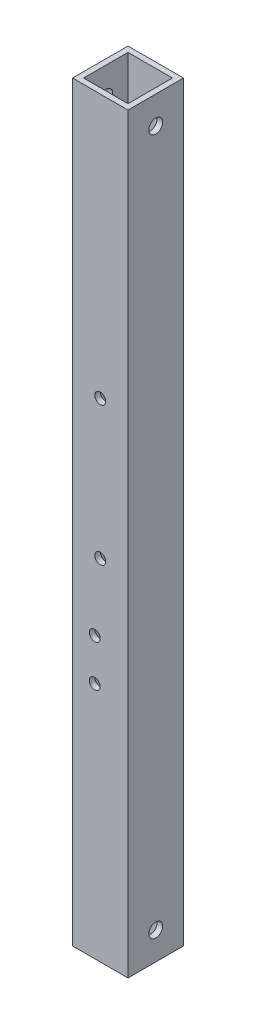
ISO-10303-21;
HEADER;
FILE_DESCRIPTION(('STEP AP214'),'2;1');
FILE_NAME('part.step','',(''),(''),'','','');
FILE_SCHEMA(('AUTOMOTIVE_DESIGN { 1 0 10303 214 1 1 1 1 }'));
ENDSEC;
DATA;
#1=APPLICATION_CONTEXT('core data for automotive mechanical design processes');
#2=APPLICATION_PROTOCOL_DEFINITION('international standard','automotive_design',2000,#1);
#3=PRODUCT_CONTEXT('',#1,'mechanical');
#4=PRODUCT('Part','Part','',(#3));
#5=PRODUCT_RELATED_PRODUCT_CATEGORY('part','',(#4));
#6=PRODUCT_DEFINITION_FORMATION('','',#4);
#7=PRODUCT_DEFINITION_CONTEXT('part definition',#1,'design');
#8=PRODUCT_DEFINITION('design','',#6,#7);
#9=PRODUCT_DEFINITION_SHAPE('','',#8);
#10=(LENGTH_UNIT() NAMED_UNIT(*) SI_UNIT(.MILLI.,.METRE.));
#11=(NAMED_UNIT(*) PLANE_ANGLE_UNIT() SI_UNIT($,.RADIAN.));
#12=(NAMED_UNIT(*) SI_UNIT($,.STERADIAN.) SOLID_ANGLE_UNIT());
#13=UNCERTAINTY_MEASURE_WITH_UNIT(LENGTH_MEASURE(1.E-05),#10,'distance_accuracy_value','');
#14=(GEOMETRIC_REPRESENTATION_CONTEXT(3) GLOBAL_UNCERTAINTY_ASSIGNED_CONTEXT((#13)) GLOBAL_UNIT_ASSIGNED_CONTEXT((#10,
#11,#12)) REPRESENTATION_CONTEXT('',''));
#15=CARTESIAN_POINT('',(0.,0.,0.));
#16=DIRECTION('',(0.,0.,1.));
#17=DIRECTION('',(1.,0.,0.));
#18=AXIS2_PLACEMENT_3D('',#15,#16,#17);
#19=CARTESIAN_POINT('',(0.,344.17,0.));
#20=DIRECTION('',(0.,1.,0.));
#21=DIRECTION('',(0.,0.,1.));
#22=AXIS2_PLACEMENT_3D('',#19,#20,#21);
#23=PLANE('',#22);
#24=DIRECTION('',(0.,0.,1.));
#25=VECTOR('',#24,1.);
#26=CARTESIAN_POINT('',(0.,344.17,0.));
#27=LINE('',#26,#25);
#28=CARTESIAN_POINT('',(0.,344.17,-25.4));
#29=VERTEX_POINT('',#28);
#30=CARTESIAN_POINT('',(0.,344.17,0.));
#31=VERTEX_POINT('',#30);
#32=EDGE_CURVE('E161',#29,#31,#27,.T.);
#33=ORIENTED_EDGE('',*,*,#32,.T.);
#34=DIRECTION('',(1.,0.,0.));
#35=VECTOR('',#34,1.);
#36=CARTESIAN_POINT('',(0.,344.17,0.));
#37=LINE('',#36,#35);
#38=CARTESIAN_POINT('',(25.4,344.17,0.));
#39=VERTEX_POINT('',#38);
#40=EDGE_CURVE('E164',#31,#39,#37,.T.);
#41=ORIENTED_EDGE('',*,*,#40,.T.);
#42=DIRECTION('',(0.,0.,-1.));
#43=VECTOR('',#42,1.);
#44=CARTESIAN_POINT('',(25.4,344.17,0.));
#45=LINE('',#44,#43);
#46=CARTESIAN_POINT('',(25.4,344.17,-25.4));
#47=VERTEX_POINT('',#46);
#48=EDGE_CURVE('E167',#39,#47,#45,.T.);
#49=ORIENTED_EDGE('',*,*,#48,.T.);
#50=DIRECTION('',(-1.,0.,0.));
#51=VECTOR('',#50,1.);
#52=CARTESIAN_POINT('',(0.,344.17,-25.4));
#53=LINE('',#52,#51);
#54=EDGE_CURVE('E169',#47,#29,#53,.T.);
#55=ORIENTED_EDGE('',*,*,#54,.T.);
#56=EDGE_LOOP('',(#33,#41,#49,#55));
#57=FACE_BOUND('',#56,.T.);
#58=DIRECTION('',(1.,0.,0.));
#59=VECTOR('',#58,1.);
#60=CARTESIAN_POINT('',(0.,344.17,-2.54));
#61=LINE('',#60,#59);
#62=CARTESIAN_POINT('',(2.54,344.17,-2.54));
#63=VERTEX_POINT('',#62);
#64=CARTESIAN_POINT('',(22.86,344.17,-2.54));
#65=VERTEX_POINT('',#64);
#66=EDGE_CURVE('E131',#63,#65,#61,.T.);
#67=ORIENTED_EDGE('',*,*,#66,.F.);
#68=DIRECTION('',(0.,0.,1.));
#69=VECTOR('',#68,1.);
#70=CARTESIAN_POINT('',(2.54,344.17,0.));
#71=LINE('',#70,#69);
#72=CARTESIAN_POINT('',(2.54,344.17,-22.86));
#73=VERTEX_POINT('',#72);
#74=EDGE_CURVE('E123',#73,#63,#71,.T.);
#75=ORIENTED_EDGE('',*,*,#74,.F.);
#76=DIRECTION('',(-1.,0.,0.));
#77=VECTOR('',#76,1.);
#78=CARTESIAN_POINT('',(0.,344.17,-22.86));
#79=LINE('',#78,#77);
#80=CARTESIAN_POINT('',(22.86,344.17,-22.86));
#81=VERTEX_POINT('',#80);
#82=EDGE_CURVE('E145',#81,#73,#79,.T.);
#83=ORIENTED_EDGE('',*,*,#82,.F.);
#84=DIRECTION('',(0.,0.,-1.));
#85=VECTOR('',#84,1.);
#86=CARTESIAN_POINT('',(22.86,344.17,0.));
#87=LINE('',#86,#85);
#88=EDGE_CURVE('E143',#65,#81,#87,.T.);
#89=ORIENTED_EDGE('',*,*,#88,.F.);
#90=EDGE_LOOP('',(#67,#75,#83,#89));
#91=FACE_BOUND('',#90,.T.);
#92=ADVANCED_FACE('F56',(#57,#91),#23,.T.);
#93=CARTESIAN_POINT('',(0.,0.,0.));
#94=DIRECTION('',(0.,1.,0.));
#95=DIRECTION('',(0.,0.,1.));
#96=AXIS2_PLACEMENT_3D('',#93,#94,#95);
#97=PLANE('',#96);
#98=DIRECTION('',(0.,0.,1.));
#99=VECTOR('',#98,1.);
#100=CARTESIAN_POINT('',(0.,0.,0.));
#101=LINE('',#100,#99);
#102=CARTESIAN_POINT('',(0.,0.,-25.4));
#103=VERTEX_POINT('',#102);
#104=CARTESIAN_POINT('',(0.,0.,0.));
#105=VERTEX_POINT('',#104);
#106=EDGE_CURVE('E139',#103,#105,#101,.T.);
#107=ORIENTED_EDGE('',*,*,#106,.F.);
#108=DIRECTION('',(-1.,0.,0.));
#109=VECTOR('',#108,1.);
#110=CARTESIAN_POINT('',(0.,0.,-25.4));
#111=LINE('',#110,#109);
#112=CARTESIAN_POINT('',(25.4,0.,-25.4));
#113=VERTEX_POINT('',#112);
#114=EDGE_CURVE('E165',#113,#103,#111,.T.);
#115=ORIENTED_EDGE('',*,*,#114,.F.);
#116=DIRECTION('',(0.,0.,-1.));
#117=VECTOR('',#116,1.);
#118=CARTESIAN_POINT('',(25.4,0.,0.));
#119=LINE('',#118,#117);
#120=CARTESIAN_POINT('',(25.4,0.,0.));
#121=VERTEX_POINT('',#120);
#122=EDGE_CURVE('E176',#121,#113,#119,.T.);
#123=ORIENTED_EDGE('',*,*,#122,.F.);
#124=DIRECTION('',(1.,0.,0.));
#125=VECTOR('',#124,1.);
#126=CARTESIAN_POINT('',(0.,0.,0.));
#127=LINE('',#126,#125);
#128=EDGE_CURVE('E174',#105,#121,#127,.T.);
#129=ORIENTED_EDGE('',*,*,#128,.F.);
#130=EDGE_LOOP('',(#107,#115,#123,#129));
#131=FACE_BOUND('',#130,.T.);
#132=DIRECTION('',(0.,0.,1.));
#133=VECTOR('',#132,1.);
#134=CARTESIAN_POINT('',(2.54,0.,0.));
#135=LINE('',#134,#133);
#136=CARTESIAN_POINT('',(2.54,0.,-22.86));
#137=VERTEX_POINT('',#136);
#138=CARTESIAN_POINT('',(2.54,0.,-2.54));
#139=VERTEX_POINT('',#138);
#140=EDGE_CURVE('E81',#137,#139,#135,.T.);
#141=ORIENTED_EDGE('',*,*,#140,.T.);
#142=DIRECTION('',(1.,0.,0.));
#143=VECTOR('',#142,1.);
#144=CARTESIAN_POINT('',(0.,0.,-2.54));
#145=LINE('',#144,#143);
#146=CARTESIAN_POINT('',(22.86,0.,-2.54));
#147=VERTEX_POINT('',#146);
#148=EDGE_CURVE('E138',#139,#147,#145,.T.);
#149=ORIENTED_EDGE('',*,*,#148,.T.);
#150=DIRECTION('',(0.,0.,-1.));
#151=VECTOR('',#150,1.);
#152=CARTESIAN_POINT('',(22.86,0.,0.));
#153=LINE('',#152,#151);
#154=CARTESIAN_POINT('',(22.86,0.,-22.86));
#155=VERTEX_POINT('',#154);
#156=EDGE_CURVE('E153',#147,#155,#153,.T.);
#157=ORIENTED_EDGE('',*,*,#156,.T.);
#158=DIRECTION('',(-1.,0.,0.));
#159=VECTOR('',#158,1.);
#160=CARTESIAN_POINT('',(0.,0.,-22.86));
#161=LINE('',#160,#159);
#162=EDGE_CURVE('E132',#155,#137,#161,.T.);
#163=ORIENTED_EDGE('',*,*,#162,.T.);
#164=EDGE_LOOP('',(#141,#149,#157,#163));
#165=FACE_BOUND('',#164,.T.);
#166=ADVANCED_FACE('F293',(#131,#165),#97,.F.);
#167=CARTESIAN_POINT('',(0.,344.17,0.));
#168=DIRECTION('',(1.,0.,0.));
#169=DIRECTION('',(0.,0.,-1.));
#170=AXIS2_PLACEMENT_3D('',#167,#168,#169);
#171=PLANE('',#170);
#172=CARTESIAN_POINT('',(0.,12.7,-12.7));
#173=DIRECTION('',(-1.,0.,0.));
#174=DIRECTION('',(0.,0.,1.));
#175=AXIS2_PLACEMENT_3D('',#172,#173,#174);
#176=CIRCLE('',#175,3.175);
#177=CARTESIAN_POINT('',(0.,12.7,-9.525));
#178=VERTEX_POINT('',#177);
#179=EDGE_CURVE('E210',#178,#178,#176,.T.);
#180=ORIENTED_EDGE('',*,*,#179,.F.);
#181=EDGE_LOOP('',(#180));
#182=FACE_BOUND('',#181,.T.);
#183=CARTESIAN_POINT('',(0.,331.47,-12.7));
#184=DIRECTION('',(-1.,0.,0.));
#185=DIRECTION('',(0.,0.,1.));
#186=AXIS2_PLACEMENT_3D('',#183,#184,#185);
#187=CIRCLE('',#186,3.175);
#188=CARTESIAN_POINT('',(0.,331.47,-9.525));
#189=VERTEX_POINT('',#188);
#190=EDGE_CURVE('E220',#189,#189,#187,.T.);
#191=ORIENTED_EDGE('',*,*,#190,.F.);
#192=EDGE_LOOP('',(#191));
#193=FACE_BOUND('',#192,.T.);
#194=ORIENTED_EDGE('',*,*,#106,.T.);
#195=DIRECTION('',(0.,-1.,0.));
#196=VECTOR('',#195,1.);
#197=CARTESIAN_POINT('',(0.,344.17,0.));
#198=LINE('',#197,#196);
#199=EDGE_CURVE('E12',#31,#105,#198,.T.);
#200=ORIENTED_EDGE('',*,*,#199,.F.);
#201=ORIENTED_EDGE('',*,*,#32,.F.);
#202=DIRECTION('',(0.,-1.,0.));
#203=VECTOR('',#202,1.);
#204=CARTESIAN_POINT('',(0.,344.17,-25.4));
#205=LINE('',#204,#203);
#206=EDGE_CURVE('E171',#29,#103,#205,.T.);
#207=ORIENTED_EDGE('',*,*,#206,.T.);
#208=EDGE_LOOP('',(#194,#200,#201,#207));
#209=FACE_BOUND('',#208,.T.);
#210=ADVANCED_FACE('F58',(#182,#193,#209),#171,.F.);
#211=CARTESIAN_POINT('',(0.,344.17,0.));
#212=DIRECTION('',(0.,0.,-1.));
#213=DIRECTION('',(-1.,0.,0.));
#214=AXIS2_PLACEMENT_3D('',#211,#212,#213);
#215=PLANE('',#214);
#216=CARTESIAN_POINT('',(10.16,109.1191,0.));
#217=DIRECTION('',(0.,0.,-1.));
#218=DIRECTION('',(-1.,0.,0.));
#219=AXIS2_PLACEMENT_3D('',#216,#217,#218);
#220=CIRCLE('',#219,2.48919999999999);
#221=CARTESIAN_POINT('',(7.67080000000006,109.1191,0.));
#222=VERTEX_POINT('',#221);
#223=EDGE_CURVE('E190',#222,#222,#220,.T.);
#224=ORIENTED_EDGE('',*,*,#223,.T.);
#225=EDGE_LOOP('',(#224));
#226=FACE_BOUND('',#225,.T.);
#227=CARTESIAN_POINT('',(10.16,128.1691,0.));
#228=DIRECTION('',(0.,0.,-1.));
#229=DIRECTION('',(-1.,0.,0.));
#230=AXIS2_PLACEMENT_3D('',#227,#228,#229);
#231=CIRCLE('',#230,2.48920000000001);
#232=CARTESIAN_POINT('',(7.67080000000004,128.1691,0.));
#233=VERTEX_POINT('',#232);
#234=EDGE_CURVE('E232',#233,#233,#231,.T.);
#235=ORIENTED_EDGE('',*,*,#234,.T.);
#236=EDGE_LOOP('',(#235));
#237=FACE_BOUND('',#236,.T.);
#238=CARTESIAN_POINT('',(12.6999999999999,160.02,0.));
#239=DIRECTION('',(0.,0.,-1.));
#240=DIRECTION('',(-1.,0.,0.));
#241=AXIS2_PLACEMENT_3D('',#238,#239,#240);
#242=CIRCLE('',#241,2.48919999999996);
#243=CARTESIAN_POINT('',(10.2107999999999,160.02,0.));
#244=VERTEX_POINT('',#243);
#245=EDGE_CURVE('E238',#244,#244,#242,.T.);
#246=ORIENTED_EDGE('',*,*,#245,.T.);
#247=EDGE_LOOP('',(#246));
#248=FACE_BOUND('',#247,.T.);
#249=CARTESIAN_POINT('',(12.7,223.52,0.));
#250=DIRECTION('',(0.,0.,-1.));
#251=DIRECTION('',(-1.,0.,0.));
#252=AXIS2_PLACEMENT_3D('',#249,#250,#251);
#253=CIRCLE('',#252,2.48919999999996);
#254=CARTESIAN_POINT('',(10.2108,223.52,0.));
#255=VERTEX_POINT('',#254);
#256=EDGE_CURVE('E244',#255,#255,#253,.T.);
#257=ORIENTED_EDGE('',*,*,#256,.T.);
#258=EDGE_LOOP('',(#257));
#259=FACE_BOUND('',#258,.T.);
#260=ORIENTED_EDGE('',*,*,#128,.T.);
#261=DIRECTION('',(0.,-1.,0.));
#262=VECTOR('',#261,1.);
#263=CARTESIAN_POINT('',(25.4,344.17,0.));
#264=LINE('',#263,#262);
#265=EDGE_CURVE('E65',#39,#121,#264,.T.);
#266=ORIENTED_EDGE('',*,*,#265,.F.);
#267=ORIENTED_EDGE('',*,*,#40,.F.);
#268=ORIENTED_EDGE('',*,*,#199,.T.);
#269=EDGE_LOOP('',(#260,#266,#267,#268));
#270=FACE_BOUND('',#269,.T.);
#271=ADVANCED_FACE('F279',(#226,#237,#248,#259,#270),#215,.F.);
#272=CARTESIAN_POINT('',(25.4,344.17,0.));
#273=DIRECTION('',(-1.,0.,0.));
#274=DIRECTION('',(0.,0.,1.));
#275=AXIS2_PLACEMENT_3D('',#272,#273,#274);
#276=PLANE('',#275);
#277=CARTESIAN_POINT('',(25.4,12.7,-12.7));
#278=DIRECTION('',(-1.,0.,0.));
#279=DIRECTION('',(0.,0.,1.));
#280=AXIS2_PLACEMENT_3D('',#277,#278,#279);
#281=CIRCLE('',#280,3.175);
#282=CARTESIAN_POINT('',(25.4,12.7,-9.525));
#283=VERTEX_POINT('',#282);
#284=EDGE_CURVE('E204',#283,#283,#281,.T.);
#285=ORIENTED_EDGE('',*,*,#284,.T.);
#286=EDGE_LOOP('',(#285));
#287=FACE_BOUND('',#286,.T.);
#288=CARTESIAN_POINT('',(25.4,331.47,-12.7));
#289=DIRECTION('',(-1.,0.,0.));
#290=DIRECTION('',(0.,0.,1.));
#291=AXIS2_PLACEMENT_3D('',#288,#289,#290);
#292=CIRCLE('',#291,3.175);
#293=CARTESIAN_POINT('',(25.4,331.47,-9.525));
#294=VERTEX_POINT('',#293);
#295=EDGE_CURVE('E215',#294,#294,#292,.T.);
#296=ORIENTED_EDGE('',*,*,#295,.T.);
#297=EDGE_LOOP('',(#296));
#298=FACE_BOUND('',#297,.T.);
#299=ORIENTED_EDGE('',*,*,#122,.T.);
#300=DIRECTION('',(0.,-1.,0.));
#301=VECTOR('',#300,1.);
#302=CARTESIAN_POINT('',(25.4,344.17,-25.4));
#303=LINE('',#302,#301);
#304=EDGE_CURVE('E181',#47,#113,#303,.T.);
#305=ORIENTED_EDGE('',*,*,#304,.F.);
#306=ORIENTED_EDGE('',*,*,#48,.F.);
#307=ORIENTED_EDGE('',*,*,#265,.T.);
#308=EDGE_LOOP('',(#299,#305,#306,#307));
#309=FACE_BOUND('',#308,.T.);
#310=ADVANCED_FACE('F282',(#287,#298,#309),#276,.F.);
#311=CARTESIAN_POINT('',(0.,344.17,-25.4));
#312=DIRECTION('',(0.,0.,1.));
#313=DIRECTION('',(1.,0.,0.));
#314=AXIS2_PLACEMENT_3D('',#311,#312,#313);
#315=PLANE('',#314);
#316=CARTESIAN_POINT('',(10.16,109.1191,-25.4));
#317=DIRECTION('',(0.,0.,-1.));
#318=DIRECTION('',(-1.,0.,0.));
#319=AXIS2_PLACEMENT_3D('',#316,#317,#318);
#320=CIRCLE('',#319,2.48919999999999);
#321=CARTESIAN_POINT('',(7.67080000000006,109.1191,-25.4));
#322=VERTEX_POINT('',#321);
#323=EDGE_CURVE('E229',#322,#322,#320,.T.);
#324=ORIENTED_EDGE('',*,*,#323,.F.);
#325=EDGE_LOOP('',(#324));
#326=FACE_BOUND('',#325,.T.);
#327=CARTESIAN_POINT('',(10.16,128.1691,-25.4));
#328=DIRECTION('',(0.,0.,-1.));
#329=DIRECTION('',(-1.,0.,0.));
#330=AXIS2_PLACEMENT_3D('',#327,#328,#329);
#331=CIRCLE('',#330,2.48920000000001);
#332=CARTESIAN_POINT('',(7.67080000000004,128.1691,-25.4));
#333=VERTEX_POINT('',#332);
#334=EDGE_CURVE('E235',#333,#333,#331,.T.);
#335=ORIENTED_EDGE('',*,*,#334,.F.);
#336=EDGE_LOOP('',(#335));
#337=FACE_BOUND('',#336,.T.);
#338=CARTESIAN_POINT('',(12.6999999999999,160.02,-25.4));
#339=DIRECTION('',(0.,0.,-1.));
#340=DIRECTION('',(-1.,0.,0.));
#341=AXIS2_PLACEMENT_3D('',#338,#339,#340);
#342=CIRCLE('',#341,2.48919999999996);
#343=CARTESIAN_POINT('',(10.2107999999999,160.02,-25.4));
#344=VERTEX_POINT('',#343);
#345=EDGE_CURVE('E241',#344,#344,#342,.T.);
#346=ORIENTED_EDGE('',*,*,#345,.F.);
#347=EDGE_LOOP('',(#346));
#348=FACE_BOUND('',#347,.T.);
#349=CARTESIAN_POINT('',(12.7,223.52,-25.4));
#350=DIRECTION('',(0.,0.,-1.));
#351=DIRECTION('',(-1.,0.,0.));
#352=AXIS2_PLACEMENT_3D('',#349,#350,#351);
#353=CIRCLE('',#352,2.48919999999996);
#354=CARTESIAN_POINT('',(10.2108,223.52,-25.4));
#355=VERTEX_POINT('',#354);
#356=EDGE_CURVE('E226',#355,#355,#353,.T.);
#357=ORIENTED_EDGE('',*,*,#356,.F.);
#358=EDGE_LOOP('',(#357));
#359=FACE_BOUND('',#358,.T.);
#360=ORIENTED_EDGE('',*,*,#114,.T.);
#361=ORIENTED_EDGE('',*,*,#206,.F.);
#362=ORIENTED_EDGE('',*,*,#54,.F.);
#363=ORIENTED_EDGE('',*,*,#304,.T.);
#364=EDGE_LOOP('',(#360,#361,#362,#363));
#365=FACE_BOUND('',#364,.T.);
#366=ADVANCED_FACE('F297',(#326,#337,#348,#359,#365),#315,.F.);
#367=CARTESIAN_POINT('',(2.54,344.17,0.));
#368=DIRECTION('',(1.,0.,0.));
#369=DIRECTION('',(0.,0.,-1.));
#370=AXIS2_PLACEMENT_3D('',#367,#368,#369);
#371=PLANE('',#370);
#372=CARTESIAN_POINT('',(2.54,12.7,-12.7));
#373=DIRECTION('',(1.,0.,0.));
#374=DIRECTION('',(0.,0.,-1.));
#375=AXIS2_PLACEMENT_3D('',#372,#373,#374);
#376=CIRCLE('',#375,3.175);
#377=CARTESIAN_POINT('',(2.54,12.7,-15.875));
#378=VERTEX_POINT('',#377);
#379=EDGE_CURVE('E223',#378,#378,#376,.T.);
#380=ORIENTED_EDGE('',*,*,#379,.F.);
#381=EDGE_LOOP('',(#380));
#382=FACE_BOUND('',#381,.T.);
#383=CARTESIAN_POINT('',(2.54,331.47,-12.7));
#384=DIRECTION('',(1.,0.,0.));
#385=DIRECTION('',(0.,0.,-1.));
#386=AXIS2_PLACEMENT_3D('',#383,#384,#385);
#387=CIRCLE('',#386,3.175);
#388=CARTESIAN_POINT('',(2.54,331.47,-15.875));
#389=VERTEX_POINT('',#388);
#390=EDGE_CURVE('E203',#389,#389,#387,.T.);
#391=ORIENTED_EDGE('',*,*,#390,.F.);
#392=EDGE_LOOP('',(#391));
#393=FACE_BOUND('',#392,.T.);
#394=ORIENTED_EDGE('',*,*,#140,.F.);
#395=DIRECTION('',(0.,-1.,0.));
#396=VECTOR('',#395,1.);
#397=CARTESIAN_POINT('',(2.54,344.17,-22.86));
#398=LINE('',#397,#396);
#399=EDGE_CURVE('E127',#73,#137,#398,.T.);
#400=ORIENTED_EDGE('',*,*,#399,.F.);
#401=ORIENTED_EDGE('',*,*,#74,.T.);
#402=DIRECTION('',(0.,-1.,0.));
#403=VECTOR('',#402,1.);
#404=CARTESIAN_POINT('',(2.54,344.17,-2.54));
#405=LINE('',#404,#403);
#406=EDGE_CURVE('E126',#63,#139,#405,.T.);
#407=ORIENTED_EDGE('',*,*,#406,.T.);
#408=EDGE_LOOP('',(#394,#400,#401,#407));
#409=FACE_BOUND('',#408,.T.);
#410=ADVANCED_FACE('F125',(#382,#393,#409),#371,.T.);
#411=CARTESIAN_POINT('',(0.,344.17,-2.54));
#412=DIRECTION('',(0.,0.,-1.));
#413=DIRECTION('',(-1.,0.,0.));
#414=AXIS2_PLACEMENT_3D('',#411,#412,#413);
#415=PLANE('',#414);
#416=CARTESIAN_POINT('',(10.16,109.1191,-2.54));
#417=DIRECTION('',(0.,0.,-1.));
#418=DIRECTION('',(-1.,0.,0.));
#419=AXIS2_PLACEMENT_3D('',#416,#417,#418);
#420=CIRCLE('',#419,2.48919999999999);
#421=CARTESIAN_POINT('',(7.67080000000006,109.1191,-2.54));
#422=VERTEX_POINT('',#421);
#423=EDGE_CURVE('E151',#422,#422,#420,.T.);
#424=ORIENTED_EDGE('',*,*,#423,.F.);
#425=EDGE_LOOP('',(#424));
#426=FACE_BOUND('',#425,.T.);
#427=CARTESIAN_POINT('',(10.16,128.1691,-2.54));
#428=DIRECTION('',(0.,0.,-1.));
#429=DIRECTION('',(-1.,0.,0.));
#430=AXIS2_PLACEMENT_3D('',#427,#428,#429);
#431=CIRCLE('',#430,2.48920000000001);
#432=CARTESIAN_POINT('',(7.67080000000004,128.1691,-2.54));
#433=VERTEX_POINT('',#432);
#434=EDGE_CURVE('E198',#433,#433,#431,.T.);
#435=ORIENTED_EDGE('',*,*,#434,.F.);
#436=EDGE_LOOP('',(#435));
#437=FACE_BOUND('',#436,.T.);
#438=CARTESIAN_POINT('',(12.6999999999999,160.02,-2.54));
#439=DIRECTION('',(0.,0.,-1.));
#440=DIRECTION('',(-1.,0.,0.));
#441=AXIS2_PLACEMENT_3D('',#438,#439,#440);
#442=CIRCLE('',#441,2.48919999999996);
#443=CARTESIAN_POINT('',(10.2107999999999,160.02,-2.54));
#444=VERTEX_POINT('',#443);
#445=EDGE_CURVE('E194',#444,#444,#442,.T.);
#446=ORIENTED_EDGE('',*,*,#445,.F.);
#447=EDGE_LOOP('',(#446));
#448=FACE_BOUND('',#447,.T.);
#449=CARTESIAN_POINT('',(12.7,223.52,-2.54));
#450=DIRECTION('',(0.,0.,-1.));
#451=DIRECTION('',(-1.,0.,0.));
#452=AXIS2_PLACEMENT_3D('',#449,#450,#451);
#453=CIRCLE('',#452,2.48919999999996);
#454=CARTESIAN_POINT('',(10.2108,223.52,-2.54));
#455=VERTEX_POINT('',#454);
#456=EDGE_CURVE('E189',#455,#455,#453,.T.);
#457=ORIENTED_EDGE('',*,*,#456,.F.);
#458=EDGE_LOOP('',(#457));
#459=FACE_BOUND('',#458,.T.);
#460=ORIENTED_EDGE('',*,*,#148,.F.);
#461=ORIENTED_EDGE('',*,*,#406,.F.);
#462=ORIENTED_EDGE('',*,*,#66,.T.);
#463=DIRECTION('',(0.,-1.,0.));
#464=VECTOR('',#463,1.);
#465=CARTESIAN_POINT('',(22.86,344.17,-2.54));
#466=LINE('',#465,#464);
#467=EDGE_CURVE('E140',#65,#147,#466,.T.);
#468=ORIENTED_EDGE('',*,*,#467,.T.);
#469=EDGE_LOOP('',(#460,#461,#462,#468));
#470=FACE_BOUND('',#469,.T.);
#471=ADVANCED_FACE('F135',(#426,#437,#448,#459,#470),#415,.T.);
#472=CARTESIAN_POINT('',(22.86,344.17,0.));
#473=DIRECTION('',(-1.,0.,0.));
#474=DIRECTION('',(0.,0.,1.));
#475=AXIS2_PLACEMENT_3D('',#472,#473,#474);
#476=PLANE('',#475);
#477=CARTESIAN_POINT('',(22.86,12.7,-12.7));
#478=DIRECTION('',(-1.,0.,0.));
#479=DIRECTION('',(0.,0.,1.));
#480=AXIS2_PLACEMENT_3D('',#477,#478,#479);
#481=CIRCLE('',#480,3.175);
#482=CARTESIAN_POINT('',(22.86,12.7,-9.525));
#483=VERTEX_POINT('',#482);
#484=EDGE_CURVE('E60',#483,#483,#481,.T.);
#485=ORIENTED_EDGE('',*,*,#484,.F.);
#486=EDGE_LOOP('',(#485));
#487=FACE_BOUND('',#486,.T.);
#488=CARTESIAN_POINT('',(22.86,331.47,-12.7));
#489=DIRECTION('',(-1.,0.,0.));
#490=DIRECTION('',(0.,0.,1.));
#491=AXIS2_PLACEMENT_3D('',#488,#489,#490);
#492=CIRCLE('',#491,3.175);
#493=CARTESIAN_POINT('',(22.86,331.47,-9.525));
#494=VERTEX_POINT('',#493);
#495=EDGE_CURVE('E201',#494,#494,#492,.T.);
#496=ORIENTED_EDGE('',*,*,#495,.F.);
#497=EDGE_LOOP('',(#496));
#498=FACE_BOUND('',#497,.T.);
#499=ORIENTED_EDGE('',*,*,#156,.F.);
#500=ORIENTED_EDGE('',*,*,#467,.F.);
#501=ORIENTED_EDGE('',*,*,#88,.T.);
#502=DIRECTION('',(0.,-1.,0.));
#503=VECTOR('',#502,1.);
#504=CARTESIAN_POINT('',(22.86,344.17,-22.86));
#505=LINE('',#504,#503);
#506=EDGE_CURVE('E73',#81,#155,#505,.T.);
#507=ORIENTED_EDGE('',*,*,#506,.T.);
#508=EDGE_LOOP('',(#499,#500,#501,#507));
#509=FACE_BOUND('',#508,.T.);
#510=ADVANCED_FACE('F262',(#487,#498,#509),#476,.T.);
#511=CARTESIAN_POINT('',(0.,344.17,-22.86));
#512=DIRECTION('',(0.,0.,1.));
#513=DIRECTION('',(1.,0.,0.));
#514=AXIS2_PLACEMENT_3D('',#511,#512,#513);
#515=PLANE('',#514);
#516=CARTESIAN_POINT('',(10.16,109.1191,-22.86));
#517=DIRECTION('',(0.,0.,1.));
#518=DIRECTION('',(1.,0.,0.));
#519=AXIS2_PLACEMENT_3D('',#516,#517,#518);
#520=CIRCLE('',#519,2.48919999999999);
#521=CARTESIAN_POINT('',(12.6492,109.1191,-22.86));
#522=VERTEX_POINT('',#521);
#523=EDGE_CURVE('E199',#522,#522,#520,.T.);
#524=ORIENTED_EDGE('',*,*,#523,.F.);
#525=EDGE_LOOP('',(#524));
#526=FACE_BOUND('',#525,.T.);
#527=CARTESIAN_POINT('',(10.16,128.1691,-22.86));
#528=DIRECTION('',(0.,0.,1.));
#529=DIRECTION('',(1.,0.,0.));
#530=AXIS2_PLACEMENT_3D('',#527,#528,#529);
#531=CIRCLE('',#530,2.48920000000001);
#532=CARTESIAN_POINT('',(12.6492000000001,128.1691,-22.86));
#533=VERTEX_POINT('',#532);
#534=EDGE_CURVE('E195',#533,#533,#531,.T.);
#535=ORIENTED_EDGE('',*,*,#534,.F.);
#536=EDGE_LOOP('',(#535));
#537=FACE_BOUND('',#536,.T.);
#538=CARTESIAN_POINT('',(12.6999999999999,160.02,-22.86));
#539=DIRECTION('',(0.,0.,1.));
#540=DIRECTION('',(1.,0.,0.));
#541=AXIS2_PLACEMENT_3D('',#538,#539,#540);
#542=CIRCLE('',#541,2.48919999999996);
#543=CARTESIAN_POINT('',(15.1891999999998,160.02,-22.86));
#544=VERTEX_POINT('',#543);
#545=EDGE_CURVE('E191',#544,#544,#542,.T.);
#546=ORIENTED_EDGE('',*,*,#545,.F.);
#547=EDGE_LOOP('',(#546));
#548=FACE_BOUND('',#547,.T.);
#549=CARTESIAN_POINT('',(12.7,223.52,-22.86));
#550=DIRECTION('',(0.,0.,1.));
#551=DIRECTION('',(1.,0.,0.));
#552=AXIS2_PLACEMENT_3D('',#549,#550,#551);
#553=CIRCLE('',#552,2.48919999999996);
#554=CARTESIAN_POINT('',(15.1891999999999,223.52,-22.86));
#555=VERTEX_POINT('',#554);
#556=EDGE_CURVE('E186',#555,#555,#553,.T.);
#557=ORIENTED_EDGE('',*,*,#556,.F.);
#558=EDGE_LOOP('',(#557));
#559=FACE_BOUND('',#558,.T.);
#560=ORIENTED_EDGE('',*,*,#162,.F.);
#561=ORIENTED_EDGE('',*,*,#506,.F.);
#562=ORIENTED_EDGE('',*,*,#82,.T.);
#563=ORIENTED_EDGE('',*,*,#399,.T.);
#564=EDGE_LOOP('',(#560,#561,#562,#563));
#565=FACE_BOUND('',#564,.T.);
#566=ADVANCED_FACE('F380',(#526,#537,#548,#559,#565),#515,.T.);
#567=CARTESIAN_POINT('',(12.7,223.52,0.));
#568=DIRECTION('',(0.,0.,-1.));
#569=DIRECTION('',(-1.,0.,0.));
#570=AXIS2_PLACEMENT_3D('',#567,#568,#569);
#571=CYLINDRICAL_SURFACE('',#570,2.48919999999996);
#572=ORIENTED_EDGE('',*,*,#556,.T.);
#573=EDGE_LOOP('',(#572));
#574=FACE_BOUND('',#573,.T.);
#575=ORIENTED_EDGE('',*,*,#356,.T.);
#576=EDGE_LOOP('',(#575));
#577=FACE_BOUND('',#576,.T.);
#578=ADVANCED_FACE('F276',(#574,#577),#571,.F.);
#579=CARTESIAN_POINT('',(12.6999999999999,160.02,0.));
#580=DIRECTION('',(0.,0.,-1.));
#581=DIRECTION('',(-1.,0.,0.));
#582=AXIS2_PLACEMENT_3D('',#579,#580,#581);
#583=CYLINDRICAL_SURFACE('',#582,2.48919999999996);
#584=ORIENTED_EDGE('',*,*,#545,.T.);
#585=EDGE_LOOP('',(#584));
#586=FACE_BOUND('',#585,.T.);
#587=ORIENTED_EDGE('',*,*,#345,.T.);
#588=EDGE_LOOP('',(#587));
#589=FACE_BOUND('',#588,.T.);
#590=ADVANCED_FACE('F394',(#586,#589),#583,.F.);
#591=CARTESIAN_POINT('',(10.16,128.1691,0.));
#592=DIRECTION('',(0.,0.,-1.));
#593=DIRECTION('',(-1.,0.,0.));
#594=AXIS2_PLACEMENT_3D('',#591,#592,#593);
#595=CYLINDRICAL_SURFACE('',#594,2.48920000000001);
#596=ORIENTED_EDGE('',*,*,#534,.T.);
#597=EDGE_LOOP('',(#596));
#598=FACE_BOUND('',#597,.T.);
#599=ORIENTED_EDGE('',*,*,#334,.T.);
#600=EDGE_LOOP('',(#599));
#601=FACE_BOUND('',#600,.T.);
#602=ADVANCED_FACE('F403',(#598,#601),#595,.F.);
#603=CARTESIAN_POINT('',(10.16,109.1191,0.));
#604=DIRECTION('',(0.,0.,-1.));
#605=DIRECTION('',(-1.,0.,0.));
#606=AXIS2_PLACEMENT_3D('',#603,#604,#605);
#607=CYLINDRICAL_SURFACE('',#606,2.48919999999999);
#608=ORIENTED_EDGE('',*,*,#523,.T.);
#609=EDGE_LOOP('',(#608));
#610=FACE_BOUND('',#609,.T.);
#611=ORIENTED_EDGE('',*,*,#323,.T.);
#612=EDGE_LOOP('',(#611));
#613=FACE_BOUND('',#612,.T.);
#614=ADVANCED_FACE('F274',(#610,#613),#607,.F.);
#615=ORIENTED_EDGE('',*,*,#456,.T.);
#616=EDGE_LOOP('',(#615));
#617=FACE_BOUND('',#616,.T.);
#618=ORIENTED_EDGE('',*,*,#256,.F.);
#619=EDGE_LOOP('',(#618));
#620=FACE_BOUND('',#619,.T.);
#621=ADVANCED_FACE('F270',(#617,#620),#571,.F.);
#622=ORIENTED_EDGE('',*,*,#445,.T.);
#623=EDGE_LOOP('',(#622));
#624=FACE_BOUND('',#623,.T.);
#625=ORIENTED_EDGE('',*,*,#245,.F.);
#626=EDGE_LOOP('',(#625));
#627=FACE_BOUND('',#626,.T.);
#628=ADVANCED_FACE('F273',(#624,#627),#583,.F.);
#629=ORIENTED_EDGE('',*,*,#434,.T.);
#630=EDGE_LOOP('',(#629));
#631=FACE_BOUND('',#630,.T.);
#632=ORIENTED_EDGE('',*,*,#234,.F.);
#633=EDGE_LOOP('',(#632));
#634=FACE_BOUND('',#633,.T.);
#635=ADVANCED_FACE('F331',(#631,#634),#595,.F.);
#636=ORIENTED_EDGE('',*,*,#423,.T.);
#637=EDGE_LOOP('',(#636));
#638=FACE_BOUND('',#637,.T.);
#639=ORIENTED_EDGE('',*,*,#223,.F.);
#640=EDGE_LOOP('',(#639));
#641=FACE_BOUND('',#640,.T.);
#642=ADVANCED_FACE('F257',(#638,#641),#607,.F.);
#643=CARTESIAN_POINT('',(25.4,331.47,-12.7));
#644=DIRECTION('',(-1.,0.,0.));
#645=DIRECTION('',(0.,0.,1.));
#646=AXIS2_PLACEMENT_3D('',#643,#644,#645);
#647=CYLINDRICAL_SURFACE('',#646,3.175);
#648=ORIENTED_EDGE('',*,*,#495,.T.);
#649=EDGE_LOOP('',(#648));
#650=FACE_BOUND('',#649,.T.);
#651=ORIENTED_EDGE('',*,*,#295,.F.);
#652=EDGE_LOOP('',(#651));
#653=FACE_BOUND('',#652,.T.);
#654=ADVANCED_FACE('F319',(#650,#653),#647,.F.);
#655=CARTESIAN_POINT('',(25.4,12.7,-12.7));
#656=DIRECTION('',(-1.,0.,0.));
#657=DIRECTION('',(0.,0.,1.));
#658=AXIS2_PLACEMENT_3D('',#655,#656,#657);
#659=CYLINDRICAL_SURFACE('',#658,3.175);
#660=ORIENTED_EDGE('',*,*,#484,.T.);
#661=EDGE_LOOP('',(#660));
#662=FACE_BOUND('',#661,.T.);
#663=ORIENTED_EDGE('',*,*,#284,.F.);
#664=EDGE_LOOP('',(#663));
#665=FACE_BOUND('',#664,.T.);
#666=ADVANCED_FACE('F321',(#662,#665),#659,.F.);
#667=ORIENTED_EDGE('',*,*,#390,.T.);
#668=EDGE_LOOP('',(#667));
#669=FACE_BOUND('',#668,.T.);
#670=ORIENTED_EDGE('',*,*,#190,.T.);
#671=EDGE_LOOP('',(#670));
#672=FACE_BOUND('',#671,.T.);
#673=ADVANCED_FACE('F323',(#669,#672),#647,.F.);
#674=ORIENTED_EDGE('',*,*,#379,.T.);
#675=EDGE_LOOP('',(#674));
#676=FACE_BOUND('',#675,.T.);
#677=ORIENTED_EDGE('',*,*,#179,.T.);
#678=EDGE_LOOP('',(#677));
#679=FACE_BOUND('',#678,.T.);
#680=ADVANCED_FACE('F330',(#676,#679),#659,.F.);
#681=CLOSED_SHELL('',(#92,#166,#210,#271,#310,#366,#410,#471,#510,#566,#578,#590,#602,#614,#621,
#628,#635,#642,#654,#666,#673,#680));
#682=MANIFOLD_SOLID_BREP('B2',#681);
#683=ADVANCED_BREP_SHAPE_REPRESENTATION('',(#18,#682),#14);
#684=SHAPE_DEFINITION_REPRESENTATION(#9,#683);
ENDSEC;
END-ISO-10303-21;
